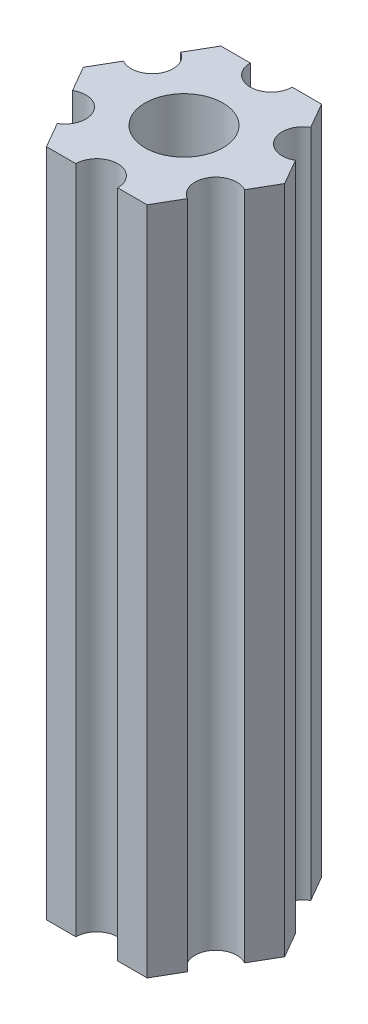
ISO-10303-21;
HEADER;
FILE_DESCRIPTION(('STEP AP214'),'2;1');
FILE_NAME('part.step','',(''),(''),'','','');
FILE_SCHEMA(('AUTOMOTIVE_DESIGN { 1 0 10303 214 1 1 1 1 }'));
ENDSEC;
DATA;
#1=APPLICATION_CONTEXT('core data for automotive mechanical design processes');
#2=APPLICATION_PROTOCOL_DEFINITION('international standard','automotive_design',2000,#1);
#3=PRODUCT_CONTEXT('',#1,'mechanical');
#4=PRODUCT('Part','Part','',(#3));
#5=PRODUCT_RELATED_PRODUCT_CATEGORY('part','',(#4));
#6=PRODUCT_DEFINITION_FORMATION('','',#4);
#7=PRODUCT_DEFINITION_CONTEXT('part definition',#1,'design');
#8=PRODUCT_DEFINITION('design','',#6,#7);
#9=PRODUCT_DEFINITION_SHAPE('','',#8);
#10=(LENGTH_UNIT() NAMED_UNIT(*) SI_UNIT(.MILLI.,.METRE.));
#11=(NAMED_UNIT(*) PLANE_ANGLE_UNIT() SI_UNIT($,.RADIAN.));
#12=(NAMED_UNIT(*) SI_UNIT($,.STERADIAN.) SOLID_ANGLE_UNIT());
#13=UNCERTAINTY_MEASURE_WITH_UNIT(LENGTH_MEASURE(1.E-05),#10,'distance_accuracy_value','');
#14=(GEOMETRIC_REPRESENTATION_CONTEXT(3) GLOBAL_UNCERTAINTY_ASSIGNED_CONTEXT((#13)) GLOBAL_UNIT_ASSIGNED_CONTEXT((#10,
#11,#12)) REPRESENTATION_CONTEXT('',''));
#15=CARTESIAN_POINT('',(0.,0.,0.));
#16=DIRECTION('',(0.,0.,1.));
#17=DIRECTION('',(1.,0.,0.));
#18=AXIS2_PLACEMENT_3D('',#15,#16,#17);
#19=CARTESIAN_POINT('',(5.41265877365274,37.,3.125));
#20=DIRECTION('',(0.,1.,0.));
#21=DIRECTION('',(0.,0.,1.));
#22=AXIS2_PLACEMENT_3D('',#19,#20,#21);
#23=CYLINDRICAL_SURFACE('',#22,1.5);
#24=CARTESIAN_POINT('',(5.41265877365274,85.,3.125));
#25=DIRECTION('',(0.,-1.,0.));
#26=DIRECTION('',(0.,0.,-1.));
#27=AXIS2_PLACEMENT_3D('',#24,#25,#26);
#28=CIRCLE('',#27,1.5);
#29=CARTESIAN_POINT('',(4.66265877365274,85.,4.42403810567666));
#30=VERTEX_POINT('',#29);
#31=CARTESIAN_POINT('',(6.16265877365274,85.,1.82596189432335));
#32=VERTEX_POINT('',#31);
#33=EDGE_CURVE('E190',#30,#32,#28,.T.);
#34=ORIENTED_EDGE('',*,*,#33,.F.);
#35=DIRECTION('',(0.,1.,0.));
#36=VECTOR('',#35,1.);
#37=CARTESIAN_POINT('',(4.66265877365274,37.,4.42403810567666));
#38=LINE('',#37,#36);
#39=CARTESIAN_POINT('',(4.66265877365274,37.,4.42403810567666));
#40=VERTEX_POINT('',#39);
#41=EDGE_CURVE('E11',#40,#30,#38,.T.);
#42=ORIENTED_EDGE('',*,*,#41,.F.);
#43=CARTESIAN_POINT('',(5.41265877365274,37.,3.125));
#44=DIRECTION('',(0.,-1.,0.));
#45=DIRECTION('',(0.,0.,-1.));
#46=AXIS2_PLACEMENT_3D('',#43,#44,#45);
#47=CIRCLE('',#46,1.5);
#48=CARTESIAN_POINT('',(6.16265877365274,37.,1.82596189432335));
#49=VERTEX_POINT('',#48);
#50=EDGE_CURVE('E241',#40,#49,#47,.T.);
#51=ORIENTED_EDGE('',*,*,#50,.T.);
#52=DIRECTION('',(0.,1.,0.));
#53=VECTOR('',#52,1.);
#54=CARTESIAN_POINT('',(6.16265877365274,37.,1.82596189432335));
#55=LINE('',#54,#53);
#56=EDGE_CURVE('E36',#49,#32,#55,.T.);
#57=ORIENTED_EDGE('',*,*,#56,.T.);
#58=EDGE_LOOP('',(#34,#42,#51,#57));
#59=FACE_BOUND('',#58,.T.);
#60=ADVANCED_FACE('F33',(#59),#23,.F.);
#61=CARTESIAN_POINT('',(3.60843918243516,37.,6.25));
#62=DIRECTION('',(0.866025403784439,0.,0.5));
#63=DIRECTION('',(0.5,0.,-0.866025403784439));
#64=AXIS2_PLACEMENT_3D('',#61,#62,#63);
#65=PLANE('',#64);
#66=DIRECTION('',(0.5,0.,-0.866025403784439));
#67=VECTOR('',#66,1.);
#68=CARTESIAN_POINT('',(3.60843918243516,85.,6.25));
#69=LINE('',#68,#67);
#70=CARTESIAN_POINT('',(3.60843918243516,85.,6.25));
#71=VERTEX_POINT('',#70);
#72=EDGE_CURVE('E239',#71,#30,#69,.T.);
#73=ORIENTED_EDGE('',*,*,#72,.F.);
#74=DIRECTION('',(0.,1.,0.));
#75=VECTOR('',#74,1.);
#76=CARTESIAN_POINT('',(3.60843918243516,37.,6.25));
#77=LINE('',#76,#75);
#78=CARTESIAN_POINT('',(3.60843918243516,37.,6.25));
#79=VERTEX_POINT('',#78);
#80=EDGE_CURVE('E42',#79,#71,#77,.T.);
#81=ORIENTED_EDGE('',*,*,#80,.F.);
#82=DIRECTION('',(0.5,0.,-0.866025403784439));
#83=VECTOR('',#82,1.);
#84=CARTESIAN_POINT('',(3.60843918243516,37.,6.25));
#85=LINE('',#84,#83);
#86=EDGE_CURVE('E180',#79,#40,#85,.T.);
#87=ORIENTED_EDGE('',*,*,#86,.T.);
#88=ORIENTED_EDGE('',*,*,#41,.T.);
#89=EDGE_LOOP('',(#73,#81,#87,#88));
#90=FACE_BOUND('',#89,.T.);
#91=ADVANCED_FACE('F273',(#90),#65,.T.);
#92=CARTESIAN_POINT('',(1.5,37.,6.25));
#93=DIRECTION('',(0.,0.,1.));
#94=DIRECTION('',(1.,0.,0.));
#95=AXIS2_PLACEMENT_3D('',#92,#93,#94);
#96=PLANE('',#95);
#97=DIRECTION('',(1.,0.,0.));
#98=VECTOR('',#97,1.);
#99=CARTESIAN_POINT('',(1.5,85.,6.25));
#100=LINE('',#99,#98);
#101=CARTESIAN_POINT('',(1.5,85.,6.25));
#102=VERTEX_POINT('',#101);
#103=EDGE_CURVE('E167',#102,#71,#100,.T.);
#104=ORIENTED_EDGE('',*,*,#103,.F.);
#105=DIRECTION('',(0.,1.,0.));
#106=VECTOR('',#105,1.);
#107=CARTESIAN_POINT('',(1.5,37.,6.25));
#108=LINE('',#107,#106);
#109=CARTESIAN_POINT('',(1.5,37.,6.25));
#110=VERTEX_POINT('',#109);
#111=EDGE_CURVE('E162',#110,#102,#108,.T.);
#112=ORIENTED_EDGE('',*,*,#111,.F.);
#113=DIRECTION('',(1.,0.,0.));
#114=VECTOR('',#113,1.);
#115=CARTESIAN_POINT('',(1.5,37.,6.25));
#116=LINE('',#115,#114);
#117=EDGE_CURVE('E165',#110,#79,#116,.T.);
#118=ORIENTED_EDGE('',*,*,#117,.T.);
#119=ORIENTED_EDGE('',*,*,#80,.T.);
#120=EDGE_LOOP('',(#104,#112,#118,#119));
#121=FACE_BOUND('',#120,.T.);
#122=ADVANCED_FACE('F164',(#121),#96,.T.);
#123=CARTESIAN_POINT('',(0.,37.,6.25));
#124=DIRECTION('',(0.,1.,0.));
#125=DIRECTION('',(0.,0.,1.));
#126=AXIS2_PLACEMENT_3D('',#123,#124,#125);
#127=CYLINDRICAL_SURFACE('',#126,1.5);
#128=CARTESIAN_POINT('',(0.,85.,6.25));
#129=DIRECTION('',(0.,-1.,0.));
#130=DIRECTION('',(0.,0.,-1.));
#131=AXIS2_PLACEMENT_3D('',#128,#129,#130);
#132=CIRCLE('',#131,1.5);
#133=CARTESIAN_POINT('',(-1.5,85.,6.25));
#134=VERTEX_POINT('',#133);
#135=EDGE_CURVE('E236',#134,#102,#132,.T.);
#136=ORIENTED_EDGE('',*,*,#135,.F.);
#137=DIRECTION('',(0.,1.,0.));
#138=VECTOR('',#137,1.);
#139=CARTESIAN_POINT('',(-1.5,37.,6.25));
#140=LINE('',#139,#138);
#141=CARTESIAN_POINT('',(-1.5,37.,6.25));
#142=VERTEX_POINT('',#141);
#143=EDGE_CURVE('E172',#142,#134,#140,.T.);
#144=ORIENTED_EDGE('',*,*,#143,.F.);
#145=CARTESIAN_POINT('',(0.,37.,6.25));
#146=DIRECTION('',(0.,-1.,0.));
#147=DIRECTION('',(0.,0.,-1.));
#148=AXIS2_PLACEMENT_3D('',#145,#146,#147);
#149=CIRCLE('',#148,1.5);
#150=EDGE_CURVE('E178',#142,#110,#149,.T.);
#151=ORIENTED_EDGE('',*,*,#150,.T.);
#152=ORIENTED_EDGE('',*,*,#111,.T.);
#153=EDGE_LOOP('',(#136,#144,#151,#152));
#154=FACE_BOUND('',#153,.T.);
#155=ADVANCED_FACE('F182',(#154),#127,.F.);
#156=CARTESIAN_POINT('',(-3.60843918243516,37.,6.25));
#157=DIRECTION('',(0.,0.,1.));
#158=DIRECTION('',(1.,0.,0.));
#159=AXIS2_PLACEMENT_3D('',#156,#157,#158);
#160=PLANE('',#159);
#161=DIRECTION('',(1.,0.,0.));
#162=VECTOR('',#161,1.);
#163=CARTESIAN_POINT('',(-3.60843918243516,85.,6.25));
#164=LINE('',#163,#162);
#165=CARTESIAN_POINT('',(-3.60843918243516,85.,6.25));
#166=VERTEX_POINT('',#165);
#167=EDGE_CURVE('E233',#166,#134,#164,.T.);
#168=ORIENTED_EDGE('',*,*,#167,.F.);
#169=DIRECTION('',(0.,1.,0.));
#170=VECTOR('',#169,1.);
#171=CARTESIAN_POINT('',(-3.60843918243516,37.,6.25));
#172=LINE('',#171,#170);
#173=CARTESIAN_POINT('',(-3.60843918243516,37.,6.25));
#174=VERTEX_POINT('',#173);
#175=EDGE_CURVE('E245',#174,#166,#172,.T.);
#176=ORIENTED_EDGE('',*,*,#175,.F.);
#177=DIRECTION('',(1.,0.,0.));
#178=VECTOR('',#177,1.);
#179=CARTESIAN_POINT('',(-3.60843918243516,37.,6.25));
#180=LINE('',#179,#178);
#181=EDGE_CURVE('E183',#174,#142,#180,.T.);
#182=ORIENTED_EDGE('',*,*,#181,.T.);
#183=ORIENTED_EDGE('',*,*,#143,.T.);
#184=EDGE_LOOP('',(#168,#176,#182,#183));
#185=FACE_BOUND('',#184,.T.);
#186=ADVANCED_FACE('F286',(#185),#160,.T.);
#187=CARTESIAN_POINT('',(-4.66265877365274,37.,4.42403810567666));
#188=DIRECTION('',(-0.866025403784439,0.,0.5));
#189=DIRECTION('',(0.5,0.,0.866025403784439));
#190=AXIS2_PLACEMENT_3D('',#187,#188,#189);
#191=PLANE('',#190);
#192=DIRECTION('',(0.5,0.,0.866025403784439));
#193=VECTOR('',#192,1.);
#194=CARTESIAN_POINT('',(-4.66265877365274,85.,4.42403810567666));
#195=LINE('',#194,#193);
#196=CARTESIAN_POINT('',(-4.66265877365274,85.,4.42403810567666));
#197=VERTEX_POINT('',#196);
#198=EDGE_CURVE('E230',#197,#166,#195,.T.);
#199=ORIENTED_EDGE('',*,*,#198,.F.);
#200=DIRECTION('',(0.,1.,0.));
#201=VECTOR('',#200,1.);
#202=CARTESIAN_POINT('',(-4.66265877365274,37.,4.42403810567666));
#203=LINE('',#202,#201);
#204=CARTESIAN_POINT('',(-4.66265877365274,37.,4.42403810567666));
#205=VERTEX_POINT('',#204);
#206=EDGE_CURVE('E247',#205,#197,#203,.T.);
#207=ORIENTED_EDGE('',*,*,#206,.F.);
#208=DIRECTION('',(0.5,0.,0.866025403784439));
#209=VECTOR('',#208,1.);
#210=CARTESIAN_POINT('',(-4.66265877365274,37.,4.42403810567666));
#211=LINE('',#210,#209);
#212=EDGE_CURVE('E185',#205,#174,#211,.T.);
#213=ORIENTED_EDGE('',*,*,#212,.T.);
#214=ORIENTED_EDGE('',*,*,#175,.T.);
#215=EDGE_LOOP('',(#199,#207,#213,#214));
#216=FACE_BOUND('',#215,.T.);
#217=ADVANCED_FACE('F289',(#216),#191,.T.);
#218=CARTESIAN_POINT('',(-5.41265877365274,37.,3.125));
#219=DIRECTION('',(0.,1.,0.));
#220=DIRECTION('',(0.,0.,1.));
#221=AXIS2_PLACEMENT_3D('',#218,#219,#220);
#222=CYLINDRICAL_SURFACE('',#221,1.5);
#223=CARTESIAN_POINT('',(-5.41265877365274,85.,3.125));
#224=DIRECTION('',(0.,-1.,0.));
#225=DIRECTION('',(0.,0.,-1.));
#226=AXIS2_PLACEMENT_3D('',#223,#224,#225);
#227=CIRCLE('',#226,1.5);
#228=CARTESIAN_POINT('',(-6.16265877365274,85.,1.82596189432335));
#229=VERTEX_POINT('',#228);
#230=EDGE_CURVE('E227',#229,#197,#227,.T.);
#231=ORIENTED_EDGE('',*,*,#230,.F.);
#232=DIRECTION('',(0.,1.,0.));
#233=VECTOR('',#232,1.);
#234=CARTESIAN_POINT('',(-6.16265877365274,37.,1.82596189432335));
#235=LINE('',#234,#233);
#236=CARTESIAN_POINT('',(-6.16265877365274,37.,1.82596189432335));
#237=VERTEX_POINT('',#236);
#238=EDGE_CURVE('E249',#237,#229,#235,.T.);
#239=ORIENTED_EDGE('',*,*,#238,.F.);
#240=CARTESIAN_POINT('',(-5.41265877365274,37.,3.125));
#241=DIRECTION('',(0.,-1.,0.));
#242=DIRECTION('',(0.,0.,-1.));
#243=AXIS2_PLACEMENT_3D('',#240,#241,#242);
#244=CIRCLE('',#243,1.5);
#245=EDGE_CURVE('E394',#237,#205,#244,.T.);
#246=ORIENTED_EDGE('',*,*,#245,.T.);
#247=ORIENTED_EDGE('',*,*,#206,.T.);
#248=EDGE_LOOP('',(#231,#239,#246,#247));
#249=FACE_BOUND('',#248,.T.);
#250=ADVANCED_FACE('F293',(#249),#222,.F.);
#251=CARTESIAN_POINT('',(-7.21687836487032,37.,0.));
#252=DIRECTION('',(-0.86602540378444,0.,0.499999999999998));
#253=DIRECTION('',(0.499999999999998,0.,0.86602540378444));
#254=AXIS2_PLACEMENT_3D('',#251,#252,#253);
#255=PLANE('',#254);
#256=DIRECTION('',(0.499999999999998,0.,0.86602540378444));
#257=VECTOR('',#256,1.);
#258=CARTESIAN_POINT('',(-7.21687836487032,85.,0.));
#259=LINE('',#258,#257);
#260=CARTESIAN_POINT('',(-7.21687836487032,85.,0.));
#261=VERTEX_POINT('',#260);
#262=EDGE_CURVE('E224',#261,#229,#259,.T.);
#263=ORIENTED_EDGE('',*,*,#262,.F.);
#264=DIRECTION('',(0.,1.,0.));
#265=VECTOR('',#264,1.);
#266=CARTESIAN_POINT('',(-7.21687836487032,37.,0.));
#267=LINE('',#266,#265);
#268=CARTESIAN_POINT('',(-7.21687836487032,37.,0.));
#269=VERTEX_POINT('',#268);
#270=EDGE_CURVE('E251',#269,#261,#267,.T.);
#271=ORIENTED_EDGE('',*,*,#270,.F.);
#272=DIRECTION('',(0.499999999999998,0.,0.86602540378444));
#273=VECTOR('',#272,1.);
#274=CARTESIAN_POINT('',(-7.21687836487032,37.,0.));
#275=LINE('',#274,#273);
#276=EDGE_CURVE('E391',#269,#237,#275,.T.);
#277=ORIENTED_EDGE('',*,*,#276,.T.);
#278=ORIENTED_EDGE('',*,*,#238,.T.);
#279=EDGE_LOOP('',(#263,#271,#277,#278));
#280=FACE_BOUND('',#279,.T.);
#281=ADVANCED_FACE('F297',(#280),#255,.T.);
#282=CARTESIAN_POINT('',(-6.16265877365274,37.,-1.82596189432334));
#283=DIRECTION('',(-0.866025403784438,0.,-0.5));
#284=DIRECTION('',(-0.5,0.,0.866025403784439));
#285=AXIS2_PLACEMENT_3D('',#282,#283,#284);
#286=PLANE('',#285);
#287=DIRECTION('',(-0.5,0.,0.866025403784438));
#288=VECTOR('',#287,1.);
#289=CARTESIAN_POINT('',(-6.16265877365274,85.,-1.82596189432334));
#290=LINE('',#289,#288);
#291=CARTESIAN_POINT('',(-6.16265877365274,85.,-1.82596189432334));
#292=VERTEX_POINT('',#291);
#293=EDGE_CURVE('E221',#292,#261,#290,.T.);
#294=ORIENTED_EDGE('',*,*,#293,.F.);
#295=DIRECTION('',(0.,1.,0.));
#296=VECTOR('',#295,1.);
#297=CARTESIAN_POINT('',(-6.16265877365274,37.,-1.82596189432334));
#298=LINE('',#297,#296);
#299=CARTESIAN_POINT('',(-6.16265877365274,37.,-1.82596189432334));
#300=VERTEX_POINT('',#299);
#301=EDGE_CURVE('E253',#300,#292,#298,.T.);
#302=ORIENTED_EDGE('',*,*,#301,.F.);
#303=DIRECTION('',(-0.5,0.,0.866025403784438));
#304=VECTOR('',#303,1.);
#305=CARTESIAN_POINT('',(-6.16265877365274,37.,-1.82596189432334));
#306=LINE('',#305,#304);
#307=EDGE_CURVE('E388',#300,#269,#306,.T.);
#308=ORIENTED_EDGE('',*,*,#307,.T.);
#309=ORIENTED_EDGE('',*,*,#270,.T.);
#310=EDGE_LOOP('',(#294,#302,#308,#309));
#311=FACE_BOUND('',#310,.T.);
#312=ADVANCED_FACE('F301',(#311),#286,.T.);
#313=CARTESIAN_POINT('',(-5.41265877365274,37.,-3.125));
#314=DIRECTION('',(0.,1.,0.));
#315=DIRECTION('',(0.,0.,1.));
#316=AXIS2_PLACEMENT_3D('',#313,#314,#315);
#317=CYLINDRICAL_SURFACE('',#316,1.5);
#318=CARTESIAN_POINT('',(-5.41265877365274,85.,-3.125));
#319=DIRECTION('',(0.,-1.,0.));
#320=DIRECTION('',(0.,0.,-1.));
#321=AXIS2_PLACEMENT_3D('',#318,#319,#320);
#322=CIRCLE('',#321,1.5);
#323=CARTESIAN_POINT('',(-4.66265877365274,85.,-4.42403810567666));
#324=VERTEX_POINT('',#323);
#325=EDGE_CURVE('E218',#324,#292,#322,.T.);
#326=ORIENTED_EDGE('',*,*,#325,.F.);
#327=DIRECTION('',(0.,1.,0.));
#328=VECTOR('',#327,1.);
#329=CARTESIAN_POINT('',(-4.66265877365274,37.,-4.42403810567666));
#330=LINE('',#329,#328);
#331=CARTESIAN_POINT('',(-4.66265877365274,37.,-4.42403810567666));
#332=VERTEX_POINT('',#331);
#333=EDGE_CURVE('E255',#332,#324,#330,.T.);
#334=ORIENTED_EDGE('',*,*,#333,.F.);
#335=CARTESIAN_POINT('',(-5.41265877365274,37.,-3.125));
#336=DIRECTION('',(0.,-1.,0.));
#337=DIRECTION('',(0.,0.,-1.));
#338=AXIS2_PLACEMENT_3D('',#335,#336,#337);
#339=CIRCLE('',#338,1.5);
#340=EDGE_CURVE('E385',#332,#300,#339,.T.);
#341=ORIENTED_EDGE('',*,*,#340,.T.);
#342=ORIENTED_EDGE('',*,*,#301,.T.);
#343=EDGE_LOOP('',(#326,#334,#341,#342));
#344=FACE_BOUND('',#343,.T.);
#345=ADVANCED_FACE('F305',(#344),#317,.F.);
#346=CARTESIAN_POINT('',(-3.60843918243516,37.,-6.25));
#347=DIRECTION('',(-0.866025403784439,0.,-0.5));
#348=DIRECTION('',(-0.5,0.,0.866025403784439));
#349=AXIS2_PLACEMENT_3D('',#346,#347,#348);
#350=PLANE('',#349);
#351=DIRECTION('',(-0.5,0.,0.866025403784439));
#352=VECTOR('',#351,1.);
#353=CARTESIAN_POINT('',(-3.60843918243516,85.,-6.25));
#354=LINE('',#353,#352);
#355=CARTESIAN_POINT('',(-3.60843918243516,85.,-6.25));
#356=VERTEX_POINT('',#355);
#357=EDGE_CURVE('E215',#356,#324,#354,.T.);
#358=ORIENTED_EDGE('',*,*,#357,.F.);
#359=DIRECTION('',(0.,1.,0.));
#360=VECTOR('',#359,1.);
#361=CARTESIAN_POINT('',(-3.60843918243516,37.,-6.25));
#362=LINE('',#361,#360);
#363=CARTESIAN_POINT('',(-3.60843918243516,37.,-6.25));
#364=VERTEX_POINT('',#363);
#365=EDGE_CURVE('E257',#364,#356,#362,.T.);
#366=ORIENTED_EDGE('',*,*,#365,.F.);
#367=DIRECTION('',(-0.5,0.,0.866025403784439));
#368=VECTOR('',#367,1.);
#369=CARTESIAN_POINT('',(-3.60843918243516,37.,-6.25));
#370=LINE('',#369,#368);
#371=EDGE_CURVE('E382',#364,#332,#370,.T.);
#372=ORIENTED_EDGE('',*,*,#371,.T.);
#373=ORIENTED_EDGE('',*,*,#333,.T.);
#374=EDGE_LOOP('',(#358,#366,#372,#373));
#375=FACE_BOUND('',#374,.T.);
#376=ADVANCED_FACE('F309',(#375),#350,.T.);
#377=CARTESIAN_POINT('',(-1.5,37.,-6.25));
#378=DIRECTION('',(0.,0.,-1.));
#379=DIRECTION('',(-1.,0.,0.));
#380=AXIS2_PLACEMENT_3D('',#377,#378,#379);
#381=PLANE('',#380);
#382=DIRECTION('',(-1.,0.,0.));
#383=VECTOR('',#382,1.);
#384=CARTESIAN_POINT('',(-1.5,85.,-6.25));
#385=LINE('',#384,#383);
#386=CARTESIAN_POINT('',(-1.5,85.,-6.25));
#387=VERTEX_POINT('',#386);
#388=EDGE_CURVE('E212',#387,#356,#385,.T.);
#389=ORIENTED_EDGE('',*,*,#388,.F.);
#390=DIRECTION('',(0.,1.,0.));
#391=VECTOR('',#390,1.);
#392=CARTESIAN_POINT('',(-1.5,37.,-6.25));
#393=LINE('',#392,#391);
#394=CARTESIAN_POINT('',(-1.5,37.,-6.25));
#395=VERTEX_POINT('',#394);
#396=EDGE_CURVE('E259',#395,#387,#393,.T.);
#397=ORIENTED_EDGE('',*,*,#396,.F.);
#398=DIRECTION('',(-1.,0.,0.));
#399=VECTOR('',#398,1.);
#400=CARTESIAN_POINT('',(-1.5,37.,-6.25));
#401=LINE('',#400,#399);
#402=EDGE_CURVE('E379',#395,#364,#401,.T.);
#403=ORIENTED_EDGE('',*,*,#402,.T.);
#404=ORIENTED_EDGE('',*,*,#365,.T.);
#405=EDGE_LOOP('',(#389,#397,#403,#404));
#406=FACE_BOUND('',#405,.T.);
#407=ADVANCED_FACE('F313',(#406),#381,.T.);
#408=CARTESIAN_POINT('',(0.,37.,-6.25));
#409=DIRECTION('',(0.,1.,0.));
#410=DIRECTION('',(0.,0.,1.));
#411=AXIS2_PLACEMENT_3D('',#408,#409,#410);
#412=CYLINDRICAL_SURFACE('',#411,1.5);
#413=CARTESIAN_POINT('',(0.,85.,-6.25));
#414=DIRECTION('',(0.,-1.,0.));
#415=DIRECTION('',(0.,0.,-1.));
#416=AXIS2_PLACEMENT_3D('',#413,#414,#415);
#417=CIRCLE('',#416,1.5);
#418=CARTESIAN_POINT('',(1.5,85.,-6.25));
#419=VERTEX_POINT('',#418);
#420=EDGE_CURVE('E209',#419,#387,#417,.T.);
#421=ORIENTED_EDGE('',*,*,#420,.F.);
#422=DIRECTION('',(0.,1.,0.));
#423=VECTOR('',#422,1.);
#424=CARTESIAN_POINT('',(1.5,37.,-6.25));
#425=LINE('',#424,#423);
#426=CARTESIAN_POINT('',(1.5,37.,-6.25));
#427=VERTEX_POINT('',#426);
#428=EDGE_CURVE('E261',#427,#419,#425,.T.);
#429=ORIENTED_EDGE('',*,*,#428,.F.);
#430=CARTESIAN_POINT('',(0.,37.,-6.25));
#431=DIRECTION('',(0.,-1.,0.));
#432=DIRECTION('',(0.,0.,-1.));
#433=AXIS2_PLACEMENT_3D('',#430,#431,#432);
#434=CIRCLE('',#433,1.5);
#435=EDGE_CURVE('E376',#427,#395,#434,.T.);
#436=ORIENTED_EDGE('',*,*,#435,.T.);
#437=ORIENTED_EDGE('',*,*,#396,.T.);
#438=EDGE_LOOP('',(#421,#429,#436,#437));
#439=FACE_BOUND('',#438,.T.);
#440=ADVANCED_FACE('F317',(#439),#412,.F.);
#441=CARTESIAN_POINT('',(3.60843918243516,37.,-6.25));
#442=DIRECTION('',(0.,0.,-1.));
#443=DIRECTION('',(-1.,0.,0.));
#444=AXIS2_PLACEMENT_3D('',#441,#442,#443);
#445=PLANE('',#444);
#446=DIRECTION('',(-1.,0.,0.));
#447=VECTOR('',#446,1.);
#448=CARTESIAN_POINT('',(3.60843918243516,85.,-6.25));
#449=LINE('',#448,#447);
#450=CARTESIAN_POINT('',(3.60843918243516,85.,-6.25));
#451=VERTEX_POINT('',#450);
#452=EDGE_CURVE('E206',#451,#419,#449,.T.);
#453=ORIENTED_EDGE('',*,*,#452,.F.);
#454=DIRECTION('',(0.,1.,0.));
#455=VECTOR('',#454,1.);
#456=CARTESIAN_POINT('',(3.60843918243516,37.,-6.25));
#457=LINE('',#456,#455);
#458=CARTESIAN_POINT('',(3.60843918243516,37.,-6.25));
#459=VERTEX_POINT('',#458);
#460=EDGE_CURVE('E263',#459,#451,#457,.T.);
#461=ORIENTED_EDGE('',*,*,#460,.F.);
#462=DIRECTION('',(-1.,0.,0.));
#463=VECTOR('',#462,1.);
#464=CARTESIAN_POINT('',(3.60843918243516,37.,-6.25));
#465=LINE('',#464,#463);
#466=EDGE_CURVE('E373',#459,#427,#465,.T.);
#467=ORIENTED_EDGE('',*,*,#466,.T.);
#468=ORIENTED_EDGE('',*,*,#428,.T.);
#469=EDGE_LOOP('',(#453,#461,#467,#468));
#470=FACE_BOUND('',#469,.T.);
#471=ADVANCED_FACE('F321',(#470),#445,.T.);
#472=CARTESIAN_POINT('',(4.66265877365274,37.,-4.42403810567666));
#473=DIRECTION('',(0.866025403784439,0.,-0.5));
#474=DIRECTION('',(-0.5,0.,-0.866025403784439));
#475=AXIS2_PLACEMENT_3D('',#472,#473,#474);
#476=PLANE('',#475);
#477=DIRECTION('',(-0.5,0.,-0.866025403784439));
#478=VECTOR('',#477,1.);
#479=CARTESIAN_POINT('',(4.66265877365274,85.,-4.42403810567666));
#480=LINE('',#479,#478);
#481=CARTESIAN_POINT('',(4.66265877365274,85.,-4.42403810567666));
#482=VERTEX_POINT('',#481);
#483=EDGE_CURVE('E203',#482,#451,#480,.T.);
#484=ORIENTED_EDGE('',*,*,#483,.F.);
#485=DIRECTION('',(0.,1.,0.));
#486=VECTOR('',#485,1.);
#487=CARTESIAN_POINT('',(4.66265877365274,37.,-4.42403810567666));
#488=LINE('',#487,#486);
#489=CARTESIAN_POINT('',(4.66265877365274,37.,-4.42403810567666));
#490=VERTEX_POINT('',#489);
#491=EDGE_CURVE('E265',#490,#482,#488,.T.);
#492=ORIENTED_EDGE('',*,*,#491,.F.);
#493=DIRECTION('',(-0.5,0.,-0.866025403784439));
#494=VECTOR('',#493,1.);
#495=CARTESIAN_POINT('',(4.66265877365274,37.,-4.42403810567666));
#496=LINE('',#495,#494);
#497=EDGE_CURVE('E370',#490,#459,#496,.T.);
#498=ORIENTED_EDGE('',*,*,#497,.T.);
#499=ORIENTED_EDGE('',*,*,#460,.T.);
#500=EDGE_LOOP('',(#484,#492,#498,#499));
#501=FACE_BOUND('',#500,.T.);
#502=ADVANCED_FACE('F325',(#501),#476,.T.);
#503=CARTESIAN_POINT('',(5.41265877365274,37.,-3.125));
#504=DIRECTION('',(0.,1.,0.));
#505=DIRECTION('',(0.,0.,1.));
#506=AXIS2_PLACEMENT_3D('',#503,#504,#505);
#507=CYLINDRICAL_SURFACE('',#506,1.5);
#508=CARTESIAN_POINT('',(5.41265877365274,85.,-3.125));
#509=DIRECTION('',(0.,-1.,0.));
#510=DIRECTION('',(0.,0.,-1.));
#511=AXIS2_PLACEMENT_3D('',#508,#509,#510);
#512=CIRCLE('',#511,1.5);
#513=CARTESIAN_POINT('',(6.16265877365274,85.,-1.82596189432334));
#514=VERTEX_POINT('',#513);
#515=EDGE_CURVE('E200',#514,#482,#512,.T.);
#516=ORIENTED_EDGE('',*,*,#515,.F.);
#517=DIRECTION('',(0.,1.,0.));
#518=VECTOR('',#517,1.);
#519=CARTESIAN_POINT('',(6.16265877365274,37.,-1.82596189432334));
#520=LINE('',#519,#518);
#521=CARTESIAN_POINT('',(6.16265877365274,37.,-1.82596189432334));
#522=VERTEX_POINT('',#521);
#523=EDGE_CURVE('E267',#522,#514,#520,.T.);
#524=ORIENTED_EDGE('',*,*,#523,.F.);
#525=CARTESIAN_POINT('',(5.41265877365274,37.,-3.125));
#526=DIRECTION('',(0.,-1.,0.));
#527=DIRECTION('',(0.,0.,-1.));
#528=AXIS2_PLACEMENT_3D('',#525,#526,#527);
#529=CIRCLE('',#528,1.5);
#530=EDGE_CURVE('E367',#522,#490,#529,.T.);
#531=ORIENTED_EDGE('',*,*,#530,.T.);
#532=ORIENTED_EDGE('',*,*,#491,.T.);
#533=EDGE_LOOP('',(#516,#524,#531,#532));
#534=FACE_BOUND('',#533,.T.);
#535=ADVANCED_FACE('F329',(#534),#507,.F.);
#536=CARTESIAN_POINT('',(7.21687836487032,37.,0.));
#537=DIRECTION('',(0.866025403784438,0.,-0.5));
#538=DIRECTION('',(-0.5,0.,-0.866025403784439));
#539=AXIS2_PLACEMENT_3D('',#536,#537,#538);
#540=PLANE('',#539);
#541=DIRECTION('',(-0.5,0.,-0.866025403784439));
#542=VECTOR('',#541,1.);
#543=CARTESIAN_POINT('',(7.21687836487032,85.,0.));
#544=LINE('',#543,#542);
#545=CARTESIAN_POINT('',(7.21687836487032,85.,0.));
#546=VERTEX_POINT('',#545);
#547=EDGE_CURVE('E197',#546,#514,#544,.T.);
#548=ORIENTED_EDGE('',*,*,#547,.F.);
#549=DIRECTION('',(0.,1.,0.));
#550=VECTOR('',#549,1.);
#551=CARTESIAN_POINT('',(7.21687836487032,37.,0.));
#552=LINE('',#551,#550);
#553=CARTESIAN_POINT('',(7.21687836487032,37.,0.));
#554=VERTEX_POINT('',#553);
#555=EDGE_CURVE('E268',#554,#546,#552,.T.);
#556=ORIENTED_EDGE('',*,*,#555,.F.);
#557=DIRECTION('',(-0.5,0.,-0.866025403784439));
#558=VECTOR('',#557,1.);
#559=CARTESIAN_POINT('',(7.21687836487032,37.,0.));
#560=LINE('',#559,#558);
#561=EDGE_CURVE('E364',#554,#522,#560,.T.);
#562=ORIENTED_EDGE('',*,*,#561,.T.);
#563=ORIENTED_EDGE('',*,*,#523,.T.);
#564=EDGE_LOOP('',(#548,#556,#562,#563));
#565=FACE_BOUND('',#564,.T.);
#566=ADVANCED_FACE('F333',(#565),#540,.T.);
#567=CARTESIAN_POINT('',(6.16265877365274,37.,1.82596189432335));
#568=DIRECTION('',(0.866025403784439,0.,0.499999999999999));
#569=DIRECTION('',(0.499999999999999,0.,-0.866025403784439));
#570=AXIS2_PLACEMENT_3D('',#567,#568,#569);
#571=PLANE('',#570);
#572=DIRECTION('',(0.499999999999999,0.,-0.86602540378444));
#573=VECTOR('',#572,1.);
#574=CARTESIAN_POINT('',(6.16265877365274,85.,1.82596189432335));
#575=LINE('',#574,#573);
#576=EDGE_CURVE('E193',#32,#546,#575,.T.);
#577=ORIENTED_EDGE('',*,*,#576,.F.);
#578=ORIENTED_EDGE('',*,*,#56,.F.);
#579=DIRECTION('',(0.499999999999999,0.,-0.86602540378444));
#580=VECTOR('',#579,1.);
#581=CARTESIAN_POINT('',(6.16265877365274,37.,1.82596189432335));
#582=LINE('',#581,#580);
#583=EDGE_CURVE('E362',#49,#554,#582,.T.);
#584=ORIENTED_EDGE('',*,*,#583,.T.);
#585=ORIENTED_EDGE('',*,*,#555,.T.);
#586=EDGE_LOOP('',(#577,#578,#584,#585));
#587=FACE_BOUND('',#586,.T.);
#588=ADVANCED_FACE('F270',(#587),#571,.T.);
#589=CARTESIAN_POINT('',(5.41265877365274,37.,3.125));
#590=DIRECTION('',(0.,-1.,0.));
#591=DIRECTION('',(0.,0.,-1.));
#592=AXIS2_PLACEMENT_3D('',#589,#590,#591);
#593=PLANE('',#592);
#594=CARTESIAN_POINT('',(0.,37.,0.));
#595=DIRECTION('',(0.,1.,0.));
#596=DIRECTION('',(0.,0.,-1.));
#597=AXIS2_PLACEMENT_3D('',#594,#595,#596);
#598=CIRCLE('',#597,2.79);
#599=CARTESIAN_POINT('',(0.,37.,-2.79));
#600=VERTEX_POINT('',#599);
#601=EDGE_CURVE('E194',#600,#600,#598,.T.);
#602=ORIENTED_EDGE('',*,*,#601,.T.);
#603=EDGE_LOOP('',(#602));
#604=FACE_BOUND('',#603,.T.);
#605=ORIENTED_EDGE('',*,*,#50,.F.);
#606=ORIENTED_EDGE('',*,*,#86,.F.);
#607=ORIENTED_EDGE('',*,*,#117,.F.);
#608=ORIENTED_EDGE('',*,*,#150,.F.);
#609=ORIENTED_EDGE('',*,*,#181,.F.);
#610=ORIENTED_EDGE('',*,*,#212,.F.);
#611=ORIENTED_EDGE('',*,*,#245,.F.);
#612=ORIENTED_EDGE('',*,*,#276,.F.);
#613=ORIENTED_EDGE('',*,*,#307,.F.);
#614=ORIENTED_EDGE('',*,*,#340,.F.);
#615=ORIENTED_EDGE('',*,*,#371,.F.);
#616=ORIENTED_EDGE('',*,*,#402,.F.);
#617=ORIENTED_EDGE('',*,*,#435,.F.);
#618=ORIENTED_EDGE('',*,*,#466,.F.);
#619=ORIENTED_EDGE('',*,*,#497,.F.);
#620=ORIENTED_EDGE('',*,*,#530,.F.);
#621=ORIENTED_EDGE('',*,*,#561,.F.);
#622=ORIENTED_EDGE('',*,*,#583,.F.);
#623=EDGE_LOOP('',(#605,#606,#607,#608,#609,#610,#611,#612,#613,#614,#615,#616,#617,#618,#619,
#620,#621,#622));
#624=FACE_BOUND('',#623,.T.);
#625=ADVANCED_FACE('F176',(#604,#624),#593,.T.);
#626=CARTESIAN_POINT('',(5.41265877365274,85.,3.125));
#627=DIRECTION('',(0.,-1.,0.));
#628=DIRECTION('',(0.,0.,-1.));
#629=AXIS2_PLACEMENT_3D('',#626,#627,#628);
#630=PLANE('',#629);
#631=CARTESIAN_POINT('',(0.,85.,0.));
#632=DIRECTION('',(0.,1.,0.));
#633=DIRECTION('',(0.,0.,-1.));
#634=AXIS2_PLACEMENT_3D('',#631,#632,#633);
#635=CIRCLE('',#634,2.79);
#636=CARTESIAN_POINT('',(0.,85.,-2.79));
#637=VERTEX_POINT('',#636);
#638=EDGE_CURVE('E357',#637,#637,#635,.T.);
#639=ORIENTED_EDGE('',*,*,#638,.F.);
#640=EDGE_LOOP('',(#639));
#641=FACE_BOUND('',#640,.T.);
#642=ORIENTED_EDGE('',*,*,#33,.T.);
#643=ORIENTED_EDGE('',*,*,#576,.T.);
#644=ORIENTED_EDGE('',*,*,#547,.T.);
#645=ORIENTED_EDGE('',*,*,#515,.T.);
#646=ORIENTED_EDGE('',*,*,#483,.T.);
#647=ORIENTED_EDGE('',*,*,#452,.T.);
#648=ORIENTED_EDGE('',*,*,#420,.T.);
#649=ORIENTED_EDGE('',*,*,#388,.T.);
#650=ORIENTED_EDGE('',*,*,#357,.T.);
#651=ORIENTED_EDGE('',*,*,#325,.T.);
#652=ORIENTED_EDGE('',*,*,#293,.T.);
#653=ORIENTED_EDGE('',*,*,#262,.T.);
#654=ORIENTED_EDGE('',*,*,#230,.T.);
#655=ORIENTED_EDGE('',*,*,#198,.T.);
#656=ORIENTED_EDGE('',*,*,#167,.T.);
#657=ORIENTED_EDGE('',*,*,#135,.T.);
#658=ORIENTED_EDGE('',*,*,#103,.T.);
#659=ORIENTED_EDGE('',*,*,#72,.T.);
#660=EDGE_LOOP('',(#642,#643,#644,#645,#646,#647,#648,#649,#650,#651,#652,#653,#654,#655,#656,
#657,#658,#659));
#661=FACE_BOUND('',#660,.T.);
#662=ADVANCED_FACE('F272',(#641,#661),#630,.F.);
#663=CARTESIAN_POINT('',(0.,37.,0.));
#664=DIRECTION('',(0.,1.,0.));
#665=DIRECTION('',(0.,0.,1.));
#666=AXIS2_PLACEMENT_3D('',#663,#664,#665);
#667=CYLINDRICAL_SURFACE('',#666,2.79);
#668=ORIENTED_EDGE('',*,*,#601,.F.);
#669=EDGE_LOOP('',(#668));
#670=FACE_BOUND('',#669,.T.);
#671=ORIENTED_EDGE('',*,*,#638,.T.);
#672=EDGE_LOOP('',(#671));
#673=FACE_BOUND('',#672,.T.);
#674=ADVANCED_FACE('F345',(#670,#673),#667,.F.);
#675=CLOSED_SHELL('',(#60,#91,#122,#155,#186,#217,#250,#281,#312,#345,#376,#407,#440,#471,#502,
#535,#566,#588,#625,#662,#674));
#676=MANIFOLD_SOLID_BREP('B2',#675);
#677=ADVANCED_BREP_SHAPE_REPRESENTATION('',(#18,#676),#14);
#678=SHAPE_DEFINITION_REPRESENTATION(#9,#677);
ENDSEC;
END-ISO-10303-21;
